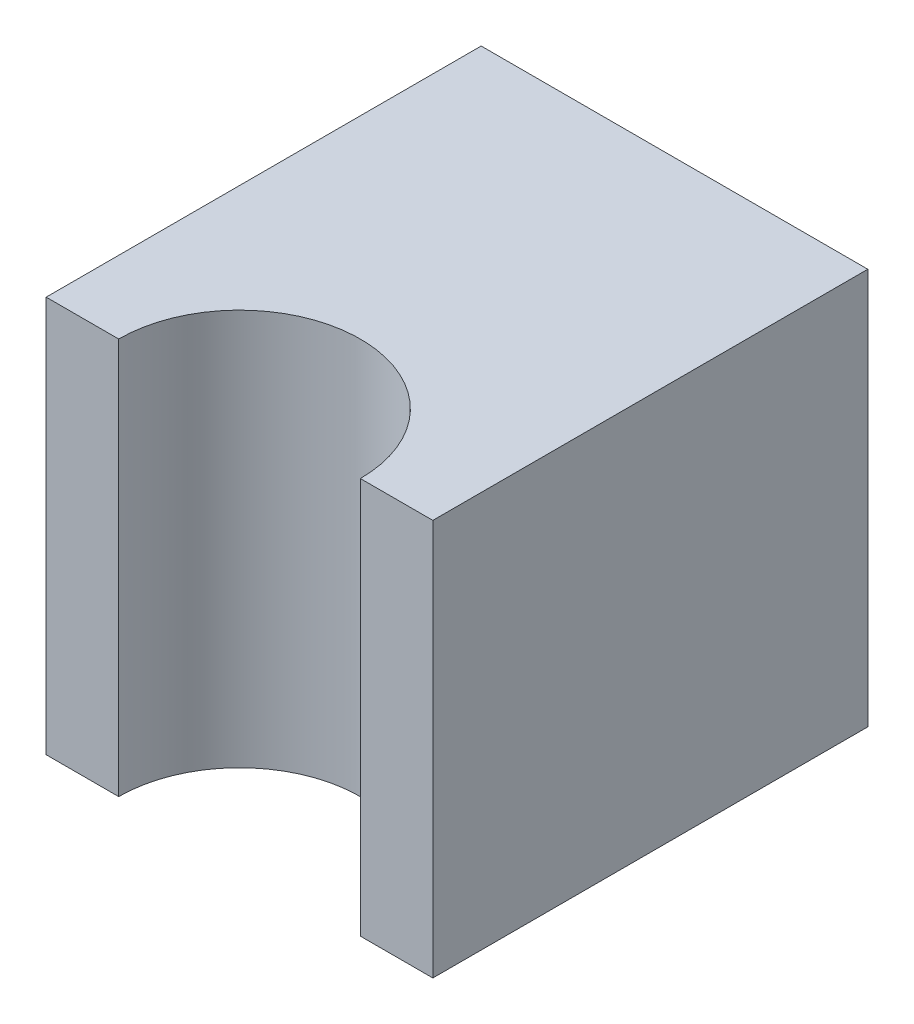
ISO-10303-21;
HEADER;
FILE_DESCRIPTION(('STEP AP214'),'2;1');
FILE_NAME('part.step','',(''),(''),'','','');
FILE_SCHEMA(('AUTOMOTIVE_DESIGN { 1 0 10303 214 1 1 1 1 }'));
ENDSEC;
DATA;
#1=APPLICATION_CONTEXT('core data for automotive mechanical design processes');
#2=APPLICATION_PROTOCOL_DEFINITION('international standard','automotive_design',2000,#1);
#3=PRODUCT_CONTEXT('',#1,'mechanical');
#4=PRODUCT('Part','Part','',(#3));
#5=PRODUCT_RELATED_PRODUCT_CATEGORY('part','',(#4));
#6=PRODUCT_DEFINITION_FORMATION('','',#4);
#7=PRODUCT_DEFINITION_CONTEXT('part definition',#1,'design');
#8=PRODUCT_DEFINITION('design','',#6,#7);
#9=PRODUCT_DEFINITION_SHAPE('','',#8);
#10=(LENGTH_UNIT() NAMED_UNIT(*) SI_UNIT(.MILLI.,.METRE.));
#11=(NAMED_UNIT(*) PLANE_ANGLE_UNIT() SI_UNIT($,.RADIAN.));
#12=(NAMED_UNIT(*) SI_UNIT($,.STERADIAN.) SOLID_ANGLE_UNIT());
#13=UNCERTAINTY_MEASURE_WITH_UNIT(LENGTH_MEASURE(1.E-05),#10,'distance_accuracy_value','');
#14=(GEOMETRIC_REPRESENTATION_CONTEXT(3) GLOBAL_UNCERTAINTY_ASSIGNED_CONTEXT((#13)) GLOBAL_UNIT_ASSIGNED_CONTEXT((#10,
#11,#12)) REPRESENTATION_CONTEXT('',''));
#15=CARTESIAN_POINT('',(0.,0.,0.));
#16=DIRECTION('',(0.,0.,1.));
#17=DIRECTION('',(1.,0.,0.));
#18=AXIS2_PLACEMENT_3D('',#15,#16,#17);
#19=CARTESIAN_POINT('',(-7.,0.,6.1));
#20=DIRECTION('',(0.,1.,0.));
#21=DIRECTION('',(0.,0.,1.));
#22=AXIS2_PLACEMENT_3D('',#19,#20,#21);
#23=CYLINDRICAL_SURFACE('',#22,0.25);
#24=DIRECTION('',(0.,1.,0.));
#25=VECTOR('',#24,1.);
#26=CARTESIAN_POINT('',(-6.75,0.,6.1));
#27=LINE('',#26,#25);
#28=CARTESIAN_POINT('',(-6.75,0.82,6.1));
#29=VERTEX_POINT('',#28);
#30=CARTESIAN_POINT('',(-6.75,0.,6.1));
#31=VERTEX_POINT('',#30);
#32=EDGE_CURVE('E119',#29,#31,#27,.F.);
#33=ORIENTED_EDGE('',*,*,#32,.F.);
#34=CARTESIAN_POINT('',(-7.,0.82,6.1));
#35=DIRECTION('',(0.,1.,0.));
#36=DIRECTION('',(0.,0.,1.));
#37=AXIS2_PLACEMENT_3D('',#34,#35,#36);
#38=CIRCLE('',#37,0.25);
#39=CARTESIAN_POINT('',(-7.25,0.82,6.1));
#40=VERTEX_POINT('',#39);
#41=EDGE_CURVE('E80',#40,#29,#38,.F.);
#42=ORIENTED_EDGE('',*,*,#41,.F.);
#43=DIRECTION('',(0.,1.,0.));
#44=VECTOR('',#43,1.);
#45=CARTESIAN_POINT('',(-7.25,0.,6.1));
#46=LINE('',#45,#44);
#47=CARTESIAN_POINT('',(-7.25,0.,6.1));
#48=VERTEX_POINT('',#47);
#49=EDGE_CURVE('E78',#48,#40,#46,.T.);
#50=ORIENTED_EDGE('',*,*,#49,.F.);
#51=CARTESIAN_POINT('',(-7.,0.,6.1));
#52=DIRECTION('',(0.,1.,0.));
#53=DIRECTION('',(0.,0.,1.));
#54=AXIS2_PLACEMENT_3D('',#51,#52,#53);
#55=CIRCLE('',#54,0.25);
#56=EDGE_CURVE('E20',#48,#31,#55,.F.);
#57=ORIENTED_EDGE('',*,*,#56,.T.);
#58=EDGE_LOOP('',(#33,#42,#50,#57));
#59=FACE_BOUND('',#58,.T.);
#60=ADVANCED_FACE('F17',(#59),#23,.F.);
#61=CARTESIAN_POINT('',(-6.75,0.,6.1));
#62=DIRECTION('',(0.,0.,1.));
#63=DIRECTION('',(1.,0.,0.));
#64=AXIS2_PLACEMENT_3D('',#61,#62,#63);
#65=PLANE('',#64);
#66=DIRECTION('',(1.,0.,0.));
#67=VECTOR('',#66,1.);
#68=CARTESIAN_POINT('',(-7.,0.82,6.1));
#69=LINE('',#68,#67);
#70=CARTESIAN_POINT('',(-6.6,0.82,6.1));
#71=VERTEX_POINT('',#70);
#72=EDGE_CURVE('E104',#29,#71,#69,.T.);
#73=ORIENTED_EDGE('',*,*,#72,.F.);
#74=ORIENTED_EDGE('',*,*,#32,.T.);
#75=DIRECTION('',(1.,0.,0.));
#76=VECTOR('',#75,1.);
#77=CARTESIAN_POINT('',(-7.,0.,6.1));
#78=LINE('',#77,#76);
#79=CARTESIAN_POINT('',(-6.6,0.,6.1));
#80=VERTEX_POINT('',#79);
#81=EDGE_CURVE('E73',#31,#80,#78,.T.);
#82=ORIENTED_EDGE('',*,*,#81,.T.);
#83=DIRECTION('',(0.,1.,0.));
#84=VECTOR('',#83,1.);
#85=CARTESIAN_POINT('',(-6.6,0.,6.1));
#86=LINE('',#85,#84);
#87=EDGE_CURVE('E76',#71,#80,#86,.F.);
#88=ORIENTED_EDGE('',*,*,#87,.F.);
#89=EDGE_LOOP('',(#73,#74,#82,#88));
#90=FACE_BOUND('',#89,.T.);
#91=ADVANCED_FACE('F196',(#90),#65,.T.);
#92=CARTESIAN_POINT('',(-6.6,0.,6.1));
#93=DIRECTION('',(1.,0.,0.));
#94=DIRECTION('',(0.,0.,-1.));
#95=AXIS2_PLACEMENT_3D('',#92,#93,#94);
#96=PLANE('',#95);
#97=DIRECTION('',(0.,0.,1.));
#98=VECTOR('',#97,1.);
#99=CARTESIAN_POINT('',(-6.6,0.82,5.65));
#100=LINE('',#99,#98);
#101=CARTESIAN_POINT('',(-6.6,0.82,5.2));
#102=VERTEX_POINT('',#101);
#103=EDGE_CURVE('E83',#71,#102,#100,.F.);
#104=ORIENTED_EDGE('',*,*,#103,.F.);
#105=ORIENTED_EDGE('',*,*,#87,.T.);
#106=DIRECTION('',(0.,0.,1.));
#107=VECTOR('',#106,1.);
#108=CARTESIAN_POINT('',(-6.6,0.,5.65));
#109=LINE('',#108,#107);
#110=CARTESIAN_POINT('',(-6.6,0.,5.2));
#111=VERTEX_POINT('',#110);
#112=EDGE_CURVE('E89',#80,#111,#109,.F.);
#113=ORIENTED_EDGE('',*,*,#112,.T.);
#114=DIRECTION('',(0.,1.,0.));
#115=VECTOR('',#114,1.);
#116=CARTESIAN_POINT('',(-6.6,0.,5.2));
#117=LINE('',#116,#115);
#118=EDGE_CURVE('E100',#102,#111,#117,.F.);
#119=ORIENTED_EDGE('',*,*,#118,.F.);
#120=EDGE_LOOP('',(#104,#105,#113,#119));
#121=FACE_BOUND('',#120,.T.);
#122=ADVANCED_FACE('F187',(#121),#96,.T.);
#123=CARTESIAN_POINT('',(-7.,0.,5.65));
#124=DIRECTION('',(0.,1.,0.));
#125=DIRECTION('',(0.,0.,1.));
#126=AXIS2_PLACEMENT_3D('',#123,#124,#125);
#127=PLANE('',#126);
#128=ORIENTED_EDGE('',*,*,#81,.F.);
#129=ORIENTED_EDGE('',*,*,#56,.F.);
#130=DIRECTION('',(1.,0.,0.));
#131=VECTOR('',#130,1.);
#132=CARTESIAN_POINT('',(-7.4,0.,6.1));
#133=LINE('',#132,#131);
#134=CARTESIAN_POINT('',(-7.4,0.,6.1));
#135=VERTEX_POINT('',#134);
#136=EDGE_CURVE('E70',#135,#48,#133,.T.);
#137=ORIENTED_EDGE('',*,*,#136,.F.);
#138=DIRECTION('',(0.,0.,1.));
#139=VECTOR('',#138,1.);
#140=CARTESIAN_POINT('',(-7.4,0.,5.2));
#141=LINE('',#140,#139);
#142=CARTESIAN_POINT('',(-7.4,0.,5.2));
#143=VERTEX_POINT('',#142);
#144=EDGE_CURVE('E98',#143,#135,#141,.T.);
#145=ORIENTED_EDGE('',*,*,#144,.F.);
#146=DIRECTION('',(-1.,0.,0.));
#147=VECTOR('',#146,1.);
#148=CARTESIAN_POINT('',(-6.6,0.,5.2));
#149=LINE('',#148,#147);
#150=EDGE_CURVE('E107',#111,#143,#149,.T.);
#151=ORIENTED_EDGE('',*,*,#150,.F.);
#152=ORIENTED_EDGE('',*,*,#112,.F.);
#153=EDGE_LOOP('',(#128,#129,#137,#145,#151,#152));
#154=FACE_BOUND('',#153,.T.);
#155=ADVANCED_FACE('F68',(#154),#127,.F.);
#156=CARTESIAN_POINT('',(-7.4,0.,6.1));
#157=DIRECTION('',(0.,0.,1.));
#158=DIRECTION('',(1.,0.,0.));
#159=AXIS2_PLACEMENT_3D('',#156,#157,#158);
#160=PLANE('',#159);
#161=DIRECTION('',(1.,0.,0.));
#162=VECTOR('',#161,1.);
#163=CARTESIAN_POINT('',(-7.,0.82,6.1));
#164=LINE('',#163,#162);
#165=CARTESIAN_POINT('',(-7.4,0.82,6.1));
#166=VERTEX_POINT('',#165);
#167=EDGE_CURVE('E105',#166,#40,#164,.T.);
#168=ORIENTED_EDGE('',*,*,#167,.F.);
#169=DIRECTION('',(0.,1.,0.));
#170=VECTOR('',#169,1.);
#171=CARTESIAN_POINT('',(-7.4,0.,6.1));
#172=LINE('',#171,#170);
#173=EDGE_CURVE('E87',#135,#166,#172,.T.);
#174=ORIENTED_EDGE('',*,*,#173,.F.);
#175=ORIENTED_EDGE('',*,*,#136,.T.);
#176=ORIENTED_EDGE('',*,*,#49,.T.);
#177=EDGE_LOOP('',(#168,#174,#175,#176));
#178=FACE_BOUND('',#177,.T.);
#179=ADVANCED_FACE('F85',(#178),#160,.T.);
#180=CARTESIAN_POINT('',(-7.,0.82,5.65));
#181=DIRECTION('',(0.,1.,0.));
#182=DIRECTION('',(0.,0.,1.));
#183=AXIS2_PLACEMENT_3D('',#180,#181,#182);
#184=PLANE('',#183);
#185=ORIENTED_EDGE('',*,*,#41,.T.);
#186=ORIENTED_EDGE('',*,*,#72,.T.);
#187=ORIENTED_EDGE('',*,*,#103,.T.);
#188=DIRECTION('',(-1.,0.,0.));
#189=VECTOR('',#188,1.);
#190=CARTESIAN_POINT('',(-6.6,0.82,5.2));
#191=LINE('',#190,#189);
#192=CARTESIAN_POINT('',(-7.4,0.82,5.2));
#193=VERTEX_POINT('',#192);
#194=EDGE_CURVE('E35',#193,#102,#191,.F.);
#195=ORIENTED_EDGE('',*,*,#194,.F.);
#196=DIRECTION('',(0.,0.,1.));
#197=VECTOR('',#196,1.);
#198=CARTESIAN_POINT('',(-7.4,0.82,5.2));
#199=LINE('',#198,#197);
#200=EDGE_CURVE('E26',#166,#193,#199,.F.);
#201=ORIENTED_EDGE('',*,*,#200,.F.);
#202=ORIENTED_EDGE('',*,*,#167,.T.);
#203=EDGE_LOOP('',(#185,#186,#187,#195,#201,#202));
#204=FACE_BOUND('',#203,.T.);
#205=ADVANCED_FACE('F145',(#204),#184,.T.);
#206=CARTESIAN_POINT('',(-6.6,0.,5.2));
#207=DIRECTION('',(0.,0.,-1.));
#208=DIRECTION('',(-1.,0.,0.));
#209=AXIS2_PLACEMENT_3D('',#206,#207,#208);
#210=PLANE('',#209);
#211=ORIENTED_EDGE('',*,*,#194,.T.);
#212=ORIENTED_EDGE('',*,*,#118,.T.);
#213=ORIENTED_EDGE('',*,*,#150,.T.);
#214=DIRECTION('',(0.,1.,0.));
#215=VECTOR('',#214,1.);
#216=CARTESIAN_POINT('',(-7.4,0.,5.2));
#217=LINE('',#216,#215);
#218=EDGE_CURVE('E11',#193,#143,#217,.F.);
#219=ORIENTED_EDGE('',*,*,#218,.F.);
#220=EDGE_LOOP('',(#211,#212,#213,#219));
#221=FACE_BOUND('',#220,.T.);
#222=ADVANCED_FACE('F141',(#221),#210,.T.);
#223=CARTESIAN_POINT('',(-7.4,0.,5.2));
#224=DIRECTION('',(-1.,0.,0.));
#225=DIRECTION('',(0.,0.,1.));
#226=AXIS2_PLACEMENT_3D('',#223,#224,#225);
#227=PLANE('',#226);
#228=ORIENTED_EDGE('',*,*,#200,.T.);
#229=ORIENTED_EDGE('',*,*,#218,.T.);
#230=ORIENTED_EDGE('',*,*,#144,.T.);
#231=ORIENTED_EDGE('',*,*,#173,.T.);
#232=EDGE_LOOP('',(#228,#229,#230,#231));
#233=FACE_BOUND('',#232,.T.);
#234=ADVANCED_FACE('F144',(#233),#227,.T.);
#235=CLOSED_SHELL('',(#60,#91,#122,#155,#179,#205,#222,#234));
#236=MANIFOLD_SOLID_BREP('B1',#235);
#237=ADVANCED_BREP_SHAPE_REPRESENTATION('',(#18,#236),#14);
#238=SHAPE_DEFINITION_REPRESENTATION(#9,#237);
ENDSEC;
END-ISO-10303-21;
